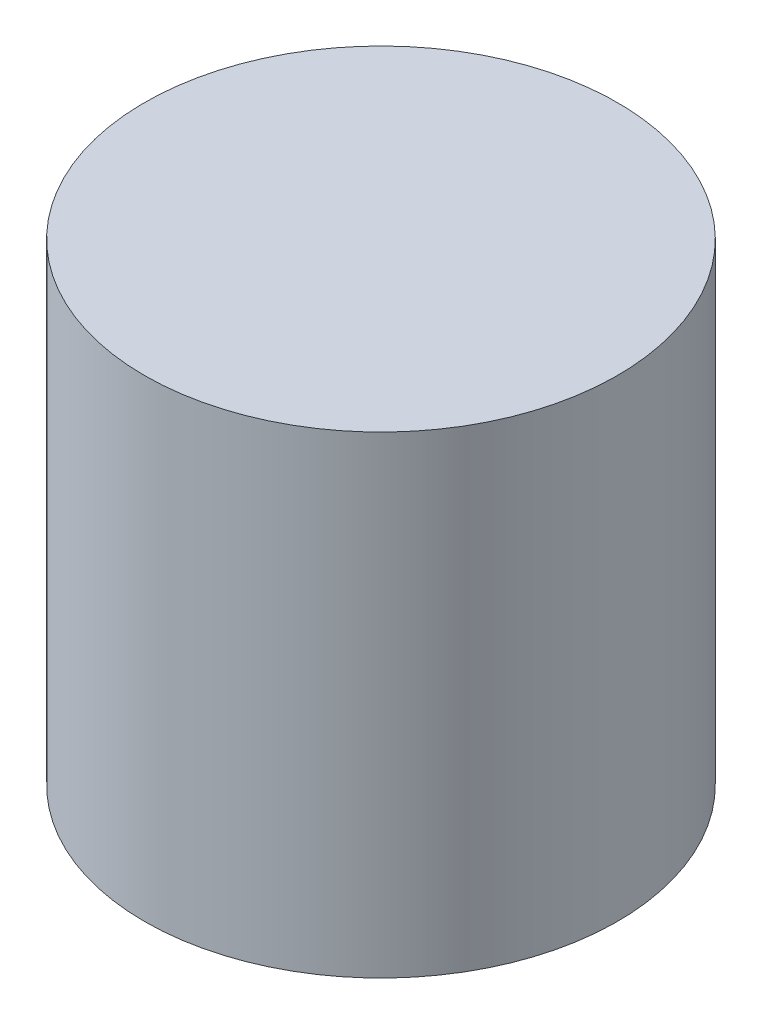
ISO-10303-21;
HEADER;
FILE_DESCRIPTION(('STEP AP214'),'2;1');
FILE_NAME('part.step','',(''),(''),'','','');
FILE_SCHEMA(('AUTOMOTIVE_DESIGN { 1 0 10303 214 1 1 1 1 }'));
ENDSEC;
DATA;
#1=APPLICATION_CONTEXT('core data for automotive mechanical design processes');
#2=APPLICATION_PROTOCOL_DEFINITION('international standard','automotive_design',2000,#1);
#3=PRODUCT_CONTEXT('',#1,'mechanical');
#4=PRODUCT('Part','Part','',(#3));
#5=PRODUCT_RELATED_PRODUCT_CATEGORY('part','',(#4));
#6=PRODUCT_DEFINITION_FORMATION('','',#4);
#7=PRODUCT_DEFINITION_CONTEXT('part definition',#1,'design');
#8=PRODUCT_DEFINITION('design','',#6,#7);
#9=PRODUCT_DEFINITION_SHAPE('','',#8);
#10=(LENGTH_UNIT() NAMED_UNIT(*) SI_UNIT(.MILLI.,.METRE.));
#11=(NAMED_UNIT(*) PLANE_ANGLE_UNIT() SI_UNIT($,.RADIAN.));
#12=(NAMED_UNIT(*) SI_UNIT($,.STERADIAN.) SOLID_ANGLE_UNIT());
#13=UNCERTAINTY_MEASURE_WITH_UNIT(LENGTH_MEASURE(1.E-05),#10,'distance_accuracy_value','');
#14=(GEOMETRIC_REPRESENTATION_CONTEXT(3) GLOBAL_UNCERTAINTY_ASSIGNED_CONTEXT((#13)) GLOBAL_UNIT_ASSIGNED_CONTEXT((#10,
#11,#12)) REPRESENTATION_CONTEXT('',''));
#15=CARTESIAN_POINT('',(0.,0.,0.));
#16=DIRECTION('',(0.,0.,1.));
#17=DIRECTION('',(1.,0.,0.));
#18=AXIS2_PLACEMENT_3D('',#15,#16,#17);
#19=CARTESIAN_POINT('',(-53.7316255141506,127.,-16.252158334527));
#20=DIRECTION('',(0.,-1.,0.));
#21=DIRECTION('',(0.,0.,-1.));
#22=AXIS2_PLACEMENT_3D('',#19,#20,#21);
#23=CYLINDRICAL_SURFACE('',#22,63.5);
#24=CARTESIAN_POINT('',(-53.7316255141506,127.,-16.252158334527));
#25=DIRECTION('',(0.,1.,0.));
#26=DIRECTION('',(0.,0.,1.));
#27=AXIS2_PLACEMENT_3D('',#24,#25,#26);
#28=CIRCLE('',#27,63.5);
#29=CARTESIAN_POINT('',(-53.7316255141506,127.,47.247841665473));
#30=VERTEX_POINT('',#29);
#31=EDGE_CURVE('E10',#30,#30,#28,.T.);
#32=ORIENTED_EDGE('',*,*,#31,.F.);
#33=EDGE_LOOP('',(#32));
#34=FACE_BOUND('',#33,.T.);
#35=CARTESIAN_POINT('',(-53.7316255141506,0.,-16.252158334527));
#36=DIRECTION('',(0.,1.,0.));
#37=DIRECTION('',(0.,0.,1.));
#38=AXIS2_PLACEMENT_3D('',#35,#36,#37);
#39=CIRCLE('',#38,63.5);
#40=CARTESIAN_POINT('',(-53.7316255141506,0.,47.247841665473));
#41=VERTEX_POINT('',#40);
#42=EDGE_CURVE('E40',#41,#41,#39,.T.);
#43=ORIENTED_EDGE('',*,*,#42,.T.);
#44=EDGE_LOOP('',(#43));
#45=FACE_BOUND('',#44,.T.);
#46=ADVANCED_FACE('F37',(#34,#45),#23,.T.);
#47=CARTESIAN_POINT('',(-53.7316255141506,127.,-16.252158334527));
#48=DIRECTION('',(0.,1.,0.));
#49=DIRECTION('',(0.,0.,1.));
#50=AXIS2_PLACEMENT_3D('',#47,#48,#49);
#51=PLANE('',#50);
#52=ORIENTED_EDGE('',*,*,#31,.T.);
#53=EDGE_LOOP('',(#52));
#54=FACE_BOUND('',#53,.T.);
#55=ADVANCED_FACE('F54',(#54),#51,.T.);
#56=CARTESIAN_POINT('',(-53.7316255141506,0.,-16.252158334527));
#57=DIRECTION('',(0.,1.,0.));
#58=DIRECTION('',(0.,0.,1.));
#59=AXIS2_PLACEMENT_3D('',#56,#57,#58);
#60=PLANE('',#59);
#61=ORIENTED_EDGE('',*,*,#42,.F.);
#62=EDGE_LOOP('',(#61));
#63=FACE_BOUND('',#62,.T.);
#64=ADVANCED_FACE('F52',(#63),#60,.F.);
#65=CLOSED_SHELL('',(#46,#55,#64));
#66=MANIFOLD_SOLID_BREP('B2',#65);
#67=ADVANCED_BREP_SHAPE_REPRESENTATION('',(#18,#66),#14);
#68=SHAPE_DEFINITION_REPRESENTATION(#9,#67);
ENDSEC;
END-ISO-10303-21;
